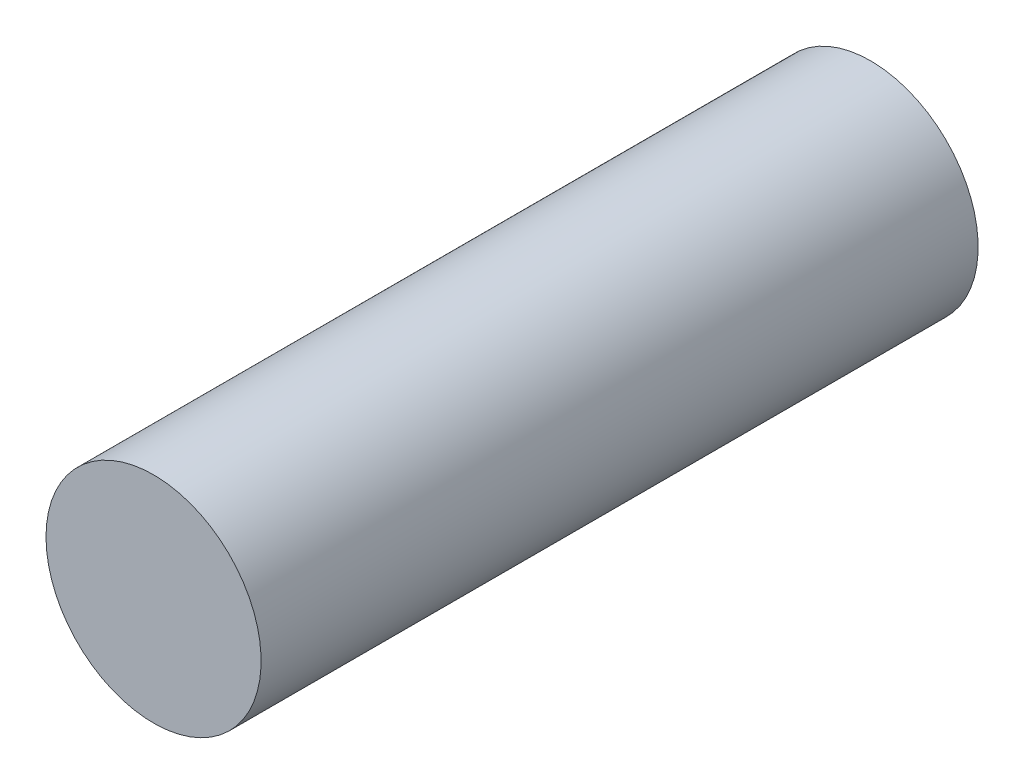
ISO-10303-21;
HEADER;
FILE_DESCRIPTION(('STEP AP214'),'2;1');
FILE_NAME('part.step','',(''),(''),'','','');
FILE_SCHEMA(('AUTOMOTIVE_DESIGN { 1 0 10303 214 1 1 1 1 }'));
ENDSEC;
DATA;
#1=APPLICATION_CONTEXT('core data for automotive mechanical design processes');
#2=APPLICATION_PROTOCOL_DEFINITION('international standard','automotive_design',2000,#1);
#3=PRODUCT_CONTEXT('',#1,'mechanical');
#4=PRODUCT('Part','Part','',(#3));
#5=PRODUCT_RELATED_PRODUCT_CATEGORY('part','',(#4));
#6=PRODUCT_DEFINITION_FORMATION('','',#4);
#7=PRODUCT_DEFINITION_CONTEXT('part definition',#1,'design');
#8=PRODUCT_DEFINITION('design','',#6,#7);
#9=PRODUCT_DEFINITION_SHAPE('','',#8);
#10=(LENGTH_UNIT() NAMED_UNIT(*) SI_UNIT(.MILLI.,.METRE.));
#11=(NAMED_UNIT(*) PLANE_ANGLE_UNIT() SI_UNIT($,.RADIAN.));
#12=(NAMED_UNIT(*) SI_UNIT($,.STERADIAN.) SOLID_ANGLE_UNIT());
#13=UNCERTAINTY_MEASURE_WITH_UNIT(LENGTH_MEASURE(1.E-05),#10,'distance_accuracy_value','');
#14=(GEOMETRIC_REPRESENTATION_CONTEXT(3) GLOBAL_UNCERTAINTY_ASSIGNED_CONTEXT((#13)) GLOBAL_UNIT_ASSIGNED_CONTEXT((#10,
#11,#12)) REPRESENTATION_CONTEXT('',''));
#15=CARTESIAN_POINT('',(0.,0.,0.));
#16=DIRECTION('',(0.,0.,1.));
#17=DIRECTION('',(1.,0.,0.));
#18=AXIS2_PLACEMENT_3D('',#15,#16,#17);
#19=CARTESIAN_POINT('',(436.189955595191,444.523939136214,909.111561189383));
#20=DIRECTION('',(0.,0.,-1.));
#21=DIRECTION('',(-1.,0.,0.));
#22=AXIS2_PLACEMENT_3D('',#19,#20,#21);
#23=CYLINDRICAL_SURFACE('',#22,150.);
#24=CARTESIAN_POINT('',(436.189955595191,444.523939136214,909.111561189383));
#25=DIRECTION('',(0.,0.,-1.));
#26=DIRECTION('',(-1.,0.,0.));
#27=AXIS2_PLACEMENT_3D('',#24,#25,#26);
#28=CIRCLE('',#27,150.);
#29=CARTESIAN_POINT('',(286.18995559519,444.523939136214,909.111561189383));
#30=VERTEX_POINT('',#29);
#31=EDGE_CURVE('E10',#30,#30,#28,.T.);
#32=ORIENTED_EDGE('',*,*,#31,.T.);
#33=EDGE_LOOP('',(#32));
#34=FACE_BOUND('',#33,.T.);
#35=CARTESIAN_POINT('',(436.189955595191,444.523939136214,-90.888438810617));
#36=DIRECTION('',(0.,0.,-1.));
#37=DIRECTION('',(-1.,0.,0.));
#38=AXIS2_PLACEMENT_3D('',#35,#36,#37);
#39=CIRCLE('',#38,150.);
#40=CARTESIAN_POINT('',(286.18995559519,444.523939136214,-90.888438810617));
#41=VERTEX_POINT('',#40);
#42=EDGE_CURVE('E40',#41,#41,#39,.T.);
#43=ORIENTED_EDGE('',*,*,#42,.F.);
#44=EDGE_LOOP('',(#43));
#45=FACE_BOUND('',#44,.T.);
#46=ADVANCED_FACE('F37',(#34,#45),#23,.T.);
#47=CARTESIAN_POINT('',(436.189955595191,444.523939136214,909.111561189383));
#48=DIRECTION('',(0.,0.,-1.));
#49=DIRECTION('',(-1.,0.,0.));
#50=AXIS2_PLACEMENT_3D('',#47,#48,#49);
#51=PLANE('',#50);
#52=ORIENTED_EDGE('',*,*,#31,.F.);
#53=EDGE_LOOP('',(#52));
#54=FACE_BOUND('',#53,.T.);
#55=ADVANCED_FACE('F52',(#54),#51,.F.);
#56=CARTESIAN_POINT('',(436.189955595191,444.523939136214,-90.888438810617));
#57=DIRECTION('',(0.,0.,-1.));
#58=DIRECTION('',(-1.,0.,0.));
#59=AXIS2_PLACEMENT_3D('',#56,#57,#58);
#60=PLANE('',#59);
#61=ORIENTED_EDGE('',*,*,#42,.T.);
#62=EDGE_LOOP('',(#61));
#63=FACE_BOUND('',#62,.T.);
#64=ADVANCED_FACE('F49',(#63),#60,.T.);
#65=CLOSED_SHELL('',(#46,#55,#64));
#66=MANIFOLD_SOLID_BREP('B2',#65);
#67=ADVANCED_BREP_SHAPE_REPRESENTATION('',(#18,#66),#14);
#68=SHAPE_DEFINITION_REPRESENTATION(#9,#67);
ENDSEC;
END-ISO-10303-21;
